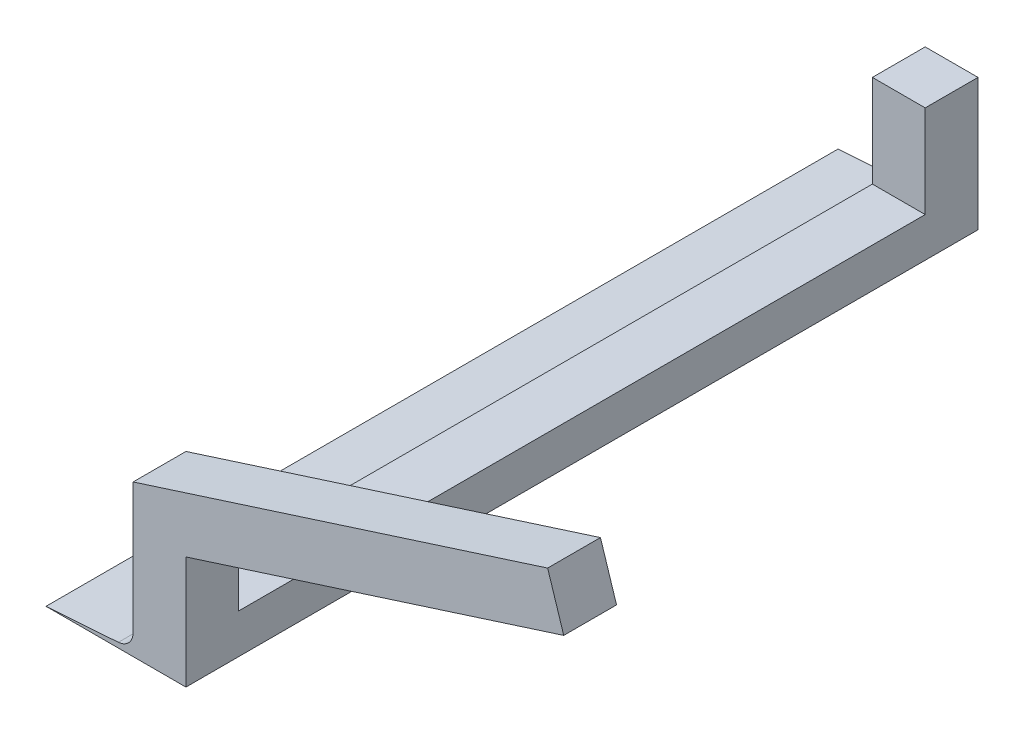
ISO-10303-21;
HEADER;
FILE_DESCRIPTION(('STEP AP214'),'2;1');
FILE_NAME('part.step','',(''),(''),'','','');
FILE_SCHEMA(('AUTOMOTIVE_DESIGN { 1 0 10303 214 1 1 1 1 }'));
ENDSEC;
DATA;
#1=APPLICATION_CONTEXT('core data for automotive mechanical design processes');
#2=APPLICATION_PROTOCOL_DEFINITION('international standard','automotive_design',2000,#1);
#3=PRODUCT_CONTEXT('',#1,'mechanical');
#4=PRODUCT('Part','Part','',(#3));
#5=PRODUCT_RELATED_PRODUCT_CATEGORY('part','',(#4));
#6=PRODUCT_DEFINITION_FORMATION('','',#4);
#7=PRODUCT_DEFINITION_CONTEXT('part definition',#1,'design');
#8=PRODUCT_DEFINITION('design','',#6,#7);
#9=PRODUCT_DEFINITION_SHAPE('','',#8);
#10=(LENGTH_UNIT() NAMED_UNIT(*) SI_UNIT(.MILLI.,.METRE.));
#11=(NAMED_UNIT(*) PLANE_ANGLE_UNIT() SI_UNIT($,.RADIAN.));
#12=(NAMED_UNIT(*) SI_UNIT($,.STERADIAN.) SOLID_ANGLE_UNIT());
#13=UNCERTAINTY_MEASURE_WITH_UNIT(LENGTH_MEASURE(1.E-05),#10,'distance_accuracy_value','');
#14=(GEOMETRIC_REPRESENTATION_CONTEXT(3) GLOBAL_UNCERTAINTY_ASSIGNED_CONTEXT((#13)) GLOBAL_UNIT_ASSIGNED_CONTEXT((#10,
#11,#12)) REPRESENTATION_CONTEXT('',''));
#15=CARTESIAN_POINT('',(0.,0.,0.));
#16=DIRECTION('',(0.,0.,1.));
#17=DIRECTION('',(1.,0.,0.));
#18=AXIS2_PLACEMENT_3D('',#15,#16,#17);
#19=CARTESIAN_POINT('',(0.,15.,300.));
#20=DIRECTION('',(0.,1.,0.));
#21=DIRECTION('',(0.,0.,1.));
#22=AXIS2_PLACEMENT_3D('',#19,#20,#21);
#23=PLANE('',#22);
#24=DIRECTION('',(0.,0.,-1.));
#25=VECTOR('',#24,1.);
#26=CARTESIAN_POINT('',(-2.,15.,300.));
#27=LINE('',#26,#25);
#28=CARTESIAN_POINT('',(-2.,15.,280.));
#29=VERTEX_POINT('',#28);
#30=CARTESIAN_POINT('',(-2.,15.,20.));
#31=VERTEX_POINT('',#30);
#32=EDGE_CURVE('E42',#29,#31,#27,.T.);
#33=ORIENTED_EDGE('',*,*,#32,.F.);
#34=DIRECTION('',(-1.,0.,0.));
#35=VECTOR('',#34,1.);
#36=CARTESIAN_POINT('',(18.,15.,280.));
#37=LINE('',#36,#35);
#38=CARTESIAN_POINT('',(18.,15.,280.));
#39=VERTEX_POINT('',#38);
#40=EDGE_CURVE('E155',#39,#29,#37,.T.);
#41=ORIENTED_EDGE('',*,*,#40,.F.);
#42=DIRECTION('',(0.,0.,-1.));
#43=VECTOR('',#42,1.);
#44=CARTESIAN_POINT('',(18.,15.,300.));
#45=LINE('',#44,#43);
#46=CARTESIAN_POINT('',(18.,15.,20.));
#47=VERTEX_POINT('',#46);
#48=EDGE_CURVE('E11',#39,#47,#45,.T.);
#49=ORIENTED_EDGE('',*,*,#48,.T.);
#50=DIRECTION('',(1.,0.,0.));
#51=VECTOR('',#50,1.);
#52=CARTESIAN_POINT('',(-2.,15.,20.));
#53=LINE('',#52,#51);
#54=EDGE_CURVE('E161',#31,#47,#53,.T.);
#55=ORIENTED_EDGE('',*,*,#54,.F.);
#56=EDGE_LOOP('',(#33,#41,#49,#55));
#57=FACE_BOUND('',#56,.T.);
#58=ADVANCED_FACE('F33',(#57),#23,.T.);
#59=CARTESIAN_POINT('',(18.,0.,300.));
#60=DIRECTION('',(1.,0.,0.));
#61=DIRECTION('',(0.,1.,0.));
#62=AXIS2_PLACEMENT_3D('',#59,#60,#61);
#63=PLANE('',#62);
#64=DIRECTION('',(0.,0.,-1.));
#65=VECTOR('',#64,1.);
#66=CARTESIAN_POINT('',(18.,42.701188925525,300.));
#67=LINE('',#66,#65);
#68=CARTESIAN_POINT('',(18.,42.701188925525,300.));
#69=VERTEX_POINT('',#68);
#70=CARTESIAN_POINT('',(18.,42.701188925525,280.));
#71=VERTEX_POINT('',#70);
#72=EDGE_CURVE('E49',#69,#71,#67,.T.);
#73=ORIENTED_EDGE('',*,*,#72,.F.);
#74=DIRECTION('',(0.,-1.,0.));
#75=VECTOR('',#74,1.);
#76=CARTESIAN_POINT('',(18.,0.,300.));
#77=LINE('',#76,#75);
#78=CARTESIAN_POINT('',(18.,0.,300.));
#79=VERTEX_POINT('',#78);
#80=EDGE_CURVE('E176',#69,#79,#77,.T.);
#81=ORIENTED_EDGE('',*,*,#80,.T.);
#82=DIRECTION('',(0.,0.,-1.));
#83=VECTOR('',#82,1.);
#84=CARTESIAN_POINT('',(18.,0.,300.));
#85=LINE('',#84,#83);
#86=CARTESIAN_POINT('',(18.,0.,0.));
#87=VERTEX_POINT('',#86);
#88=EDGE_CURVE('E203',#79,#87,#85,.T.);
#89=ORIENTED_EDGE('',*,*,#88,.T.);
#90=DIRECTION('',(0.,-1.,0.));
#91=VECTOR('',#90,1.);
#92=CARTESIAN_POINT('',(18.,0.,0.));
#93=LINE('',#92,#91);
#94=CARTESIAN_POINT('',(18.,50.,0.));
#95=VERTEX_POINT('',#94);
#96=EDGE_CURVE('E190',#95,#87,#93,.T.);
#97=ORIENTED_EDGE('',*,*,#96,.F.);
#98=DIRECTION('',(0.,0.,-1.));
#99=VECTOR('',#98,1.);
#100=CARTESIAN_POINT('',(18.,50.,0.));
#101=LINE('',#100,#99);
#102=CARTESIAN_POINT('',(18.,50.,20.));
#103=VERTEX_POINT('',#102);
#104=EDGE_CURVE('E167',#103,#95,#101,.T.);
#105=ORIENTED_EDGE('',*,*,#104,.F.);
#106=DIRECTION('',(0.,-1.,0.));
#107=VECTOR('',#106,1.);
#108=CARTESIAN_POINT('',(18.,50.,20.));
#109=LINE('',#108,#107);
#110=EDGE_CURVE('E173',#103,#47,#109,.T.);
#111=ORIENTED_EDGE('',*,*,#110,.T.);
#112=ORIENTED_EDGE('',*,*,#48,.F.);
#113=DIRECTION('',(0.,-1.,0.));
#114=VECTOR('',#113,1.);
#115=CARTESIAN_POINT('',(18.,50.,280.));
#116=LINE('',#115,#114);
#117=EDGE_CURVE('E54',#71,#39,#116,.T.);
#118=ORIENTED_EDGE('',*,*,#117,.F.);
#119=EDGE_LOOP('',(#73,#81,#89,#97,#105,#111,#112,#118));
#120=FACE_BOUND('',#119,.T.);
#121=ADVANCED_FACE('F35',(#120),#63,.T.);
#122=CARTESIAN_POINT('',(-2.,0.,300.));
#123=DIRECTION('',(1.,0.,0.));
#124=DIRECTION('',(0.,0.,-1.));
#125=AXIS2_PLACEMENT_3D('',#122,#123,#124);
#126=PLANE('',#125);
#127=DIRECTION('',(0.,0.,-1.));
#128=VECTOR('',#127,1.);
#129=CARTESIAN_POINT('',(-2.,7.8924418458807,300.));
#130=LINE('',#129,#128);
#131=CARTESIAN_POINT('',(-2.,7.8924418458807,300.));
#132=VERTEX_POINT('',#131);
#133=CARTESIAN_POINT('',(-2.,7.8924418458807,0.));
#134=VERTEX_POINT('',#133);
#135=EDGE_CURVE('E192',#132,#134,#130,.T.);
#136=ORIENTED_EDGE('',*,*,#135,.F.);
#137=DIRECTION('',(0.,-1.,0.));
#138=VECTOR('',#137,1.);
#139=CARTESIAN_POINT('',(-2.,0.,300.));
#140=LINE('',#139,#138);
#141=CARTESIAN_POINT('',(-2.,57.298811074475,300.));
#142=VERTEX_POINT('',#141);
#143=EDGE_CURVE('E222',#142,#132,#140,.T.);
#144=ORIENTED_EDGE('',*,*,#143,.F.);
#145=DIRECTION('',(0.,0.,1.));
#146=VECTOR('',#145,1.);
#147=CARTESIAN_POINT('',(-2.,57.298811074475,102.015946899905));
#148=LINE('',#147,#146);
#149=CARTESIAN_POINT('',(-2.,57.298811074475,280.));
#150=VERTEX_POINT('',#149);
#151=EDGE_CURVE('E130',#150,#142,#148,.T.);
#152=ORIENTED_EDGE('',*,*,#151,.F.);
#153=DIRECTION('',(0.,-1.,0.));
#154=VECTOR('',#153,1.);
#155=CARTESIAN_POINT('',(-2.,50.,280.));
#156=LINE('',#155,#154);
#157=EDGE_CURVE('E158',#150,#29,#156,.T.);
#158=ORIENTED_EDGE('',*,*,#157,.T.);
#159=ORIENTED_EDGE('',*,*,#32,.T.);
#160=DIRECTION('',(0.,-1.,0.));
#161=VECTOR('',#160,1.);
#162=CARTESIAN_POINT('',(-2.,50.,20.));
#163=LINE('',#162,#161);
#164=CARTESIAN_POINT('',(-2.,50.,20.));
#165=VERTEX_POINT('',#164);
#166=EDGE_CURVE('E185',#165,#31,#163,.T.);
#167=ORIENTED_EDGE('',*,*,#166,.F.);
#168=DIRECTION('',(0.,0.,1.));
#169=VECTOR('',#168,1.);
#170=CARTESIAN_POINT('',(-2.,50.,0.));
#171=LINE('',#170,#169);
#172=CARTESIAN_POINT('',(-2.,50.,0.));
#173=VERTEX_POINT('',#172);
#174=EDGE_CURVE('E162',#173,#165,#171,.T.);
#175=ORIENTED_EDGE('',*,*,#174,.F.);
#176=DIRECTION('',(0.,-1.,0.));
#177=VECTOR('',#176,1.);
#178=CARTESIAN_POINT('',(-2.,0.,0.));
#179=LINE('',#178,#177);
#180=EDGE_CURVE('E213',#173,#134,#179,.T.);
#181=ORIENTED_EDGE('',*,*,#180,.T.);
#182=EDGE_LOOP('',(#136,#144,#152,#158,#159,#167,#175,#181));
#183=FACE_BOUND('',#182,.T.);
#184=ADVANCED_FACE('F253',(#183),#126,.F.);
#185=CARTESIAN_POINT('',(-8.,7.89244184588066,300.));
#186=DIRECTION('',(0.,0.,-1.));
#187=DIRECTION('',(-1.,0.,0.));
#188=AXIS2_PLACEMENT_3D('',#185,#186,#187);
#189=CYLINDRICAL_SURFACE('',#188,6.);
#190=CARTESIAN_POINT('',(-8.,7.89244184588066,0.));
#191=DIRECTION('',(0.,0.,1.));
#192=DIRECTION('',(1.,0.,0.));
#193=AXIS2_PLACEMENT_3D('',#190,#191,#192);
#194=CIRCLE('',#193,6.);
#195=CARTESIAN_POINT('',(-7.58368439843103,1.90690249508776,0.));
#196=VERTEX_POINT('',#195);
#197=EDGE_CURVE('E211',#134,#196,#194,.F.);
#198=ORIENTED_EDGE('',*,*,#197,.T.);
#199=DIRECTION('',(0.,0.,-1.));
#200=VECTOR('',#199,1.);
#201=CARTESIAN_POINT('',(-7.58368439843103,1.90690249508776,300.));
#202=LINE('',#201,#200);
#203=CARTESIAN_POINT('',(-7.58368439843103,1.90690249508776,300.));
#204=VERTEX_POINT('',#203);
#205=EDGE_CURVE('E197',#204,#196,#202,.T.);
#206=ORIENTED_EDGE('',*,*,#205,.F.);
#207=CARTESIAN_POINT('',(-8.,7.89244184588066,300.));
#208=DIRECTION('',(0.,0.,1.));
#209=DIRECTION('',(1.,0.,0.));
#210=AXIS2_PLACEMENT_3D('',#207,#208,#209);
#211=CIRCLE('',#210,6.);
#212=EDGE_CURVE('E221',#132,#204,#211,.F.);
#213=ORIENTED_EDGE('',*,*,#212,.F.);
#214=ORIENTED_EDGE('',*,*,#135,.T.);
#215=EDGE_LOOP('',(#198,#206,#213,#214));
#216=FACE_BOUND('',#215,.T.);
#217=ADVANCED_FACE('F258',(#216),#189,.F.);
#218=CARTESIAN_POINT('',(-0.168504272328939,2.42265470955309,300.));
#219=DIRECTION('',(0.0693859335948349,-0.997589891798816,0.));
#220=DIRECTION('',(0.997589891798816,0.0693859335948349,0.));
#221=AXIS2_PLACEMENT_3D('',#218,#219,#220);
#222=PLANE('',#221);
#223=DIRECTION('',(-0.997589891798816,-0.0693859335948349,0.));
#224=VECTOR('',#223,1.);
#225=CARTESIAN_POINT('',(-0.168504272328939,2.42265470955309,0.));
#226=LINE('',#225,#224);
#227=CARTESIAN_POINT('',(-35.,0.,0.));
#228=VERTEX_POINT('',#227);
#229=EDGE_CURVE('E209',#196,#228,#226,.T.);
#230=ORIENTED_EDGE('',*,*,#229,.T.);
#231=DIRECTION('',(0.,0.,-1.));
#232=VECTOR('',#231,1.);
#233=CARTESIAN_POINT('',(-35.,0.,300.));
#234=LINE('',#233,#232);
#235=CARTESIAN_POINT('',(-35.,0.,300.));
#236=VERTEX_POINT('',#235);
#237=EDGE_CURVE('E200',#236,#228,#234,.T.);
#238=ORIENTED_EDGE('',*,*,#237,.F.);
#239=DIRECTION('',(-0.997589891798816,-0.0693859335948349,0.));
#240=VECTOR('',#239,1.);
#241=CARTESIAN_POINT('',(-0.168504272328939,2.42265470955309,300.));
#242=LINE('',#241,#240);
#243=EDGE_CURVE('E219',#204,#236,#242,.T.);
#244=ORIENTED_EDGE('',*,*,#243,.F.);
#245=ORIENTED_EDGE('',*,*,#205,.T.);
#246=EDGE_LOOP('',(#230,#238,#244,#245));
#247=FACE_BOUND('',#246,.T.);
#248=ADVANCED_FACE('F260',(#247),#222,.F.);
#249=CARTESIAN_POINT('',(0.,0.,300.));
#250=DIRECTION('',(0.,1.,0.));
#251=DIRECTION('',(0.,0.,1.));
#252=AXIS2_PLACEMENT_3D('',#249,#250,#251);
#253=PLANE('',#252);
#254=DIRECTION('',(1.,0.,0.));
#255=VECTOR('',#254,1.);
#256=CARTESIAN_POINT('',(0.,0.,0.));
#257=LINE('',#256,#255);
#258=EDGE_CURVE('E206',#228,#87,#257,.T.);
#259=ORIENTED_EDGE('',*,*,#258,.T.);
#260=ORIENTED_EDGE('',*,*,#88,.F.);
#261=DIRECTION('',(1.,0.,0.));
#262=VECTOR('',#261,1.);
#263=CARTESIAN_POINT('',(0.,0.,300.));
#264=LINE('',#263,#262);
#265=EDGE_CURVE('E205',#236,#79,#264,.T.);
#266=ORIENTED_EDGE('',*,*,#265,.F.);
#267=ORIENTED_EDGE('',*,*,#237,.T.);
#268=EDGE_LOOP('',(#259,#260,#266,#267));
#269=FACE_BOUND('',#268,.T.);
#270=ADVANCED_FACE('F229',(#269),#253,.F.);
#271=CARTESIAN_POINT('',(0.,0.,300.));
#272=DIRECTION('',(0.,0.,1.));
#273=DIRECTION('',(1.,0.,0.));
#274=AXIS2_PLACEMENT_3D('',#271,#272,#273);
#275=PLANE('',#274);
#276=ORIENTED_EDGE('',*,*,#80,.F.);
#277=DIRECTION('',(0.952395799643278,0.304864299028012,0.));
#278=VECTOR('',#277,1.);
#279=CARTESIAN_POINT('',(-2.,36.2991384515057,300.));
#280=LINE('',#279,#278);
#281=CARTESIAN_POINT('',(161.097861188709,88.5071754282411,300.));
#282=VERTEX_POINT('',#281);
#283=EDGE_CURVE('E131',#69,#282,#280,.T.);
#284=ORIENTED_EDGE('',*,*,#283,.T.);
#285=DIRECTION('',(-0.304864299028012,0.952395799643278,0.));
#286=VECTOR('',#285,1.);
#287=CARTESIAN_POINT('',(158.049218198429,98.0311334246739,300.));
#288=LINE('',#287,#286);
#289=CARTESIAN_POINT('',(155.000575208149,107.555091421107,300.));
#290=VERTEX_POINT('',#289);
#291=EDGE_CURVE('E126',#282,#290,#288,.T.);
#292=ORIENTED_EDGE('',*,*,#291,.T.);
#293=DIRECTION('',(-0.952395799643278,-0.304864299028013,0.));
#294=VECTOR('',#293,1.);
#295=CARTESIAN_POINT('',(155.000575208149,107.555091421107,300.));
#296=LINE('',#295,#294);
#297=EDGE_CURVE('E135',#290,#142,#296,.T.);
#298=ORIENTED_EDGE('',*,*,#297,.T.);
#299=ORIENTED_EDGE('',*,*,#143,.T.);
#300=ORIENTED_EDGE('',*,*,#212,.T.);
#301=ORIENTED_EDGE('',*,*,#243,.T.);
#302=ORIENTED_EDGE('',*,*,#265,.T.);
#303=EDGE_LOOP('',(#276,#284,#292,#298,#299,#300,#301,#302));
#304=FACE_BOUND('',#303,.T.);
#305=ADVANCED_FACE('F140',(#304),#275,.T.);
#306=CARTESIAN_POINT('',(0.,0.,0.));
#307=DIRECTION('',(0.,0.,1.));
#308=DIRECTION('',(1.,0.,0.));
#309=AXIS2_PLACEMENT_3D('',#306,#307,#308);
#310=PLANE('',#309);
#311=ORIENTED_EDGE('',*,*,#96,.T.);
#312=ORIENTED_EDGE('',*,*,#258,.F.);
#313=ORIENTED_EDGE('',*,*,#229,.F.);
#314=ORIENTED_EDGE('',*,*,#197,.F.);
#315=ORIENTED_EDGE('',*,*,#180,.F.);
#316=DIRECTION('',(-1.,0.,0.));
#317=VECTOR('',#316,1.);
#318=CARTESIAN_POINT('',(-2.,50.,0.));
#319=LINE('',#318,#317);
#320=EDGE_CURVE('E170',#95,#173,#319,.T.);
#321=ORIENTED_EDGE('',*,*,#320,.F.);
#322=EDGE_LOOP('',(#311,#312,#313,#314,#315,#321));
#323=FACE_BOUND('',#322,.T.);
#324=ADVANCED_FACE('F234',(#323),#310,.F.);
#325=CARTESIAN_POINT('',(-2.,50.,20.));
#326=DIRECTION('',(0.,0.,-1.));
#327=DIRECTION('',(-1.,0.,0.));
#328=AXIS2_PLACEMENT_3D('',#325,#326,#327);
#329=PLANE('',#328);
#330=ORIENTED_EDGE('',*,*,#54,.T.);
#331=ORIENTED_EDGE('',*,*,#110,.F.);
#332=DIRECTION('',(1.,0.,0.));
#333=VECTOR('',#332,1.);
#334=CARTESIAN_POINT('',(-2.,50.,20.));
#335=LINE('',#334,#333);
#336=EDGE_CURVE('E165',#165,#103,#335,.T.);
#337=ORIENTED_EDGE('',*,*,#336,.F.);
#338=ORIENTED_EDGE('',*,*,#166,.T.);
#339=EDGE_LOOP('',(#330,#331,#337,#338));
#340=FACE_BOUND('',#339,.T.);
#341=ADVANCED_FACE('F242',(#340),#329,.F.);
#342=CARTESIAN_POINT('',(0.,50.,0.));
#343=DIRECTION('',(0.,1.,0.));
#344=DIRECTION('',(0.,0.,1.));
#345=AXIS2_PLACEMENT_3D('',#342,#343,#344);
#346=PLANE('',#345);
#347=ORIENTED_EDGE('',*,*,#174,.T.);
#348=ORIENTED_EDGE('',*,*,#336,.T.);
#349=ORIENTED_EDGE('',*,*,#104,.T.);
#350=ORIENTED_EDGE('',*,*,#320,.T.);
#351=EDGE_LOOP('',(#347,#348,#349,#350));
#352=FACE_BOUND('',#351,.T.);
#353=ADVANCED_FACE('F237',(#352),#346,.T.);
#354=CARTESIAN_POINT('',(18.,50.,280.));
#355=DIRECTION('',(0.,0.,1.));
#356=DIRECTION('',(1.,0.,0.));
#357=AXIS2_PLACEMENT_3D('',#354,#355,#356);
#358=PLANE('',#357);
#359=DIRECTION('',(-0.952395799643278,-0.304864299028012,0.));
#360=VECTOR('',#359,1.);
#361=CARTESIAN_POINT('',(-2.,36.2991384515057,280.));
#362=LINE('',#361,#360);
#363=CARTESIAN_POINT('',(161.097861188709,88.5071754282411,280.));
#364=VERTEX_POINT('',#363);
#365=EDGE_CURVE('E145',#364,#71,#362,.T.);
#366=ORIENTED_EDGE('',*,*,#365,.T.);
#367=ORIENTED_EDGE('',*,*,#117,.T.);
#368=ORIENTED_EDGE('',*,*,#40,.T.);
#369=ORIENTED_EDGE('',*,*,#157,.F.);
#370=DIRECTION('',(0.952395799643278,0.304864299028013,0.));
#371=VECTOR('',#370,1.);
#372=CARTESIAN_POINT('',(155.000575208149,107.555091421107,280.));
#373=LINE('',#372,#371);
#374=CARTESIAN_POINT('',(155.000575208149,107.555091421107,280.));
#375=VERTEX_POINT('',#374);
#376=EDGE_CURVE('E151',#150,#375,#373,.T.);
#377=ORIENTED_EDGE('',*,*,#376,.T.);
#378=DIRECTION('',(0.304864299028012,-0.952395799643278,0.));
#379=VECTOR('',#378,1.);
#380=CARTESIAN_POINT('',(158.049218198429,98.0311334246739,280.));
#381=LINE('',#380,#379);
#382=EDGE_CURVE('E127',#375,#364,#381,.T.);
#383=ORIENTED_EDGE('',*,*,#382,.T.);
#384=EDGE_LOOP('',(#366,#367,#368,#369,#377,#383));
#385=FACE_BOUND('',#384,.T.);
#386=ADVANCED_FACE('F249',(#385),#358,.F.);
#387=CARTESIAN_POINT('',(-2.,36.2991384515057,102.015946899905));
#388=DIRECTION('',(0.304864299028012,-0.952395799643278,0.));
#389=DIRECTION('',(0.952395799643278,0.304864299028012,0.));
#390=AXIS2_PLACEMENT_3D('',#387,#388,#389);
#391=PLANE('',#390);
#392=ORIENTED_EDGE('',*,*,#283,.F.);
#393=ORIENTED_EDGE('',*,*,#72,.T.);
#394=ORIENTED_EDGE('',*,*,#365,.F.);
#395=DIRECTION('',(0.,0.,1.));
#396=VECTOR('',#395,1.);
#397=CARTESIAN_POINT('',(161.097861188709,88.5071754282411,102.015946899905));
#398=LINE('',#397,#396);
#399=EDGE_CURVE('E149',#364,#282,#398,.T.);
#400=ORIENTED_EDGE('',*,*,#399,.T.);
#401=EDGE_LOOP('',(#392,#393,#394,#400));
#402=FACE_BOUND('',#401,.T.);
#403=ADVANCED_FACE('F311',(#402),#391,.T.);
#404=CARTESIAN_POINT('',(155.000575208149,107.555091421107,102.015946899905));
#405=DIRECTION('',(-0.304864299028013,0.952395799643278,0.));
#406=DIRECTION('',(-0.952395799643278,-0.304864299028013,0.));
#407=AXIS2_PLACEMENT_3D('',#404,#405,#406);
#408=PLANE('',#407);
#409=ORIENTED_EDGE('',*,*,#376,.F.);
#410=ORIENTED_EDGE('',*,*,#151,.T.);
#411=ORIENTED_EDGE('',*,*,#297,.F.);
#412=DIRECTION('',(0.,0.,1.));
#413=VECTOR('',#412,1.);
#414=CARTESIAN_POINT('',(155.000575208149,107.555091421107,102.015946899905));
#415=LINE('',#414,#413);
#416=EDGE_CURVE('E121',#375,#290,#415,.T.);
#417=ORIENTED_EDGE('',*,*,#416,.F.);
#418=EDGE_LOOP('',(#409,#410,#411,#417));
#419=FACE_BOUND('',#418,.T.);
#420=ADVANCED_FACE('F136',(#419),#408,.T.);
#421=CARTESIAN_POINT('',(158.049218198429,98.0311334246739,102.015946899905));
#422=DIRECTION('',(0.952395799643278,0.304864299028012,0.));
#423=DIRECTION('',(-0.304864299028012,0.952395799643278,0.));
#424=AXIS2_PLACEMENT_3D('',#421,#422,#423);
#425=PLANE('',#424);
#426=ORIENTED_EDGE('',*,*,#382,.F.);
#427=ORIENTED_EDGE('',*,*,#416,.T.);
#428=ORIENTED_EDGE('',*,*,#291,.F.);
#429=ORIENTED_EDGE('',*,*,#399,.F.);
#430=EDGE_LOOP('',(#426,#427,#428,#429));
#431=FACE_BOUND('',#430,.T.);
#432=ADVANCED_FACE('F123',(#431),#425,.T.);
#433=CLOSED_SHELL('',(#58,#121,#184,#217,#248,#270,#305,#324,#341,#353,#386,#403,#420,#432));
#434=MANIFOLD_SOLID_BREP('B2',#433);
#435=ADVANCED_BREP_SHAPE_REPRESENTATION('',(#18,#434),#14);
#436=SHAPE_DEFINITION_REPRESENTATION(#9,#435);
ENDSEC;
END-ISO-10303-21;
